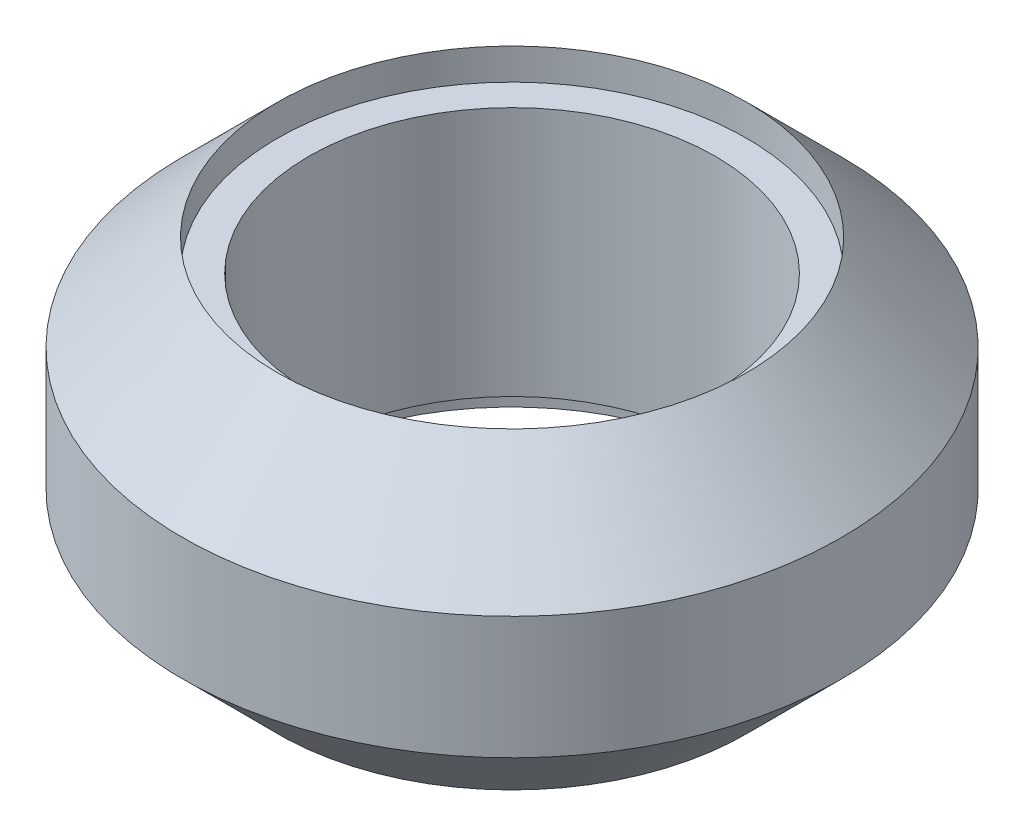
ISO-10303-21;
HEADER;
FILE_DESCRIPTION(('STEP AP214'),'2;1');
FILE_NAME('part.step','',(''),(''),'','','');
FILE_SCHEMA(('AUTOMOTIVE_DESIGN { 1 0 10303 214 1 1 1 1 }'));
ENDSEC;
DATA;
#1=APPLICATION_CONTEXT('core data for automotive mechanical design processes');
#2=APPLICATION_PROTOCOL_DEFINITION('international standard','automotive_design',2000,#1);
#3=PRODUCT_CONTEXT('',#1,'mechanical');
#4=PRODUCT('Part','Part','',(#3));
#5=PRODUCT_RELATED_PRODUCT_CATEGORY('part','',(#4));
#6=PRODUCT_DEFINITION_FORMATION('','',#4);
#7=PRODUCT_DEFINITION_CONTEXT('part definition',#1,'design');
#8=PRODUCT_DEFINITION('design','',#6,#7);
#9=PRODUCT_DEFINITION_SHAPE('','',#8);
#10=(LENGTH_UNIT() NAMED_UNIT(*) SI_UNIT(.MILLI.,.METRE.));
#11=(NAMED_UNIT(*) PLANE_ANGLE_UNIT() SI_UNIT($,.RADIAN.));
#12=(NAMED_UNIT(*) SI_UNIT($,.STERADIAN.) SOLID_ANGLE_UNIT());
#13=UNCERTAINTY_MEASURE_WITH_UNIT(LENGTH_MEASURE(1.E-05),#10,'distance_accuracy_value','');
#14=(GEOMETRIC_REPRESENTATION_CONTEXT(3) GLOBAL_UNCERTAINTY_ASSIGNED_CONTEXT((#13)) GLOBAL_UNIT_ASSIGNED_CONTEXT((#10,
#11,#12)) REPRESENTATION_CONTEXT('',''));
#15=CARTESIAN_POINT('',(0.,0.,0.));
#16=DIRECTION('',(0.,0.,1.));
#17=DIRECTION('',(1.,0.,0.));
#18=AXIS2_PLACEMENT_3D('',#15,#16,#17);
#19=CARTESIAN_POINT('',(0.,0.,0.));
#20=DIRECTION('',(0.,1.,0.));
#21=DIRECTION('',(0.,0.,1.));
#22=AXIS2_PLACEMENT_3D('',#19,#20,#21);
#23=CYLINDRICAL_SURFACE('',#22,6.5);
#24=CARTESIAN_POINT('',(0.,1.,0.));
#25=DIRECTION('',(0.,-1.,0.));
#26=DIRECTION('',(0.,0.,-1.));
#27=AXIS2_PLACEMENT_3D('',#24,#25,#26);
#28=CIRCLE('',#27,6.5);
#29=CARTESIAN_POINT('',(0.,1.,-6.5));
#30=VERTEX_POINT('',#29);
#31=EDGE_CURVE('E64',#30,#30,#28,.T.);
#32=ORIENTED_EDGE('',*,*,#31,.T.);
#33=EDGE_LOOP('',(#32));
#34=FACE_BOUND('',#33,.T.);
#35=CARTESIAN_POINT('',(0.,9.,0.));
#36=DIRECTION('',(0.,1.,0.));
#37=DIRECTION('',(0.,0.,1.));
#38=AXIS2_PLACEMENT_3D('',#35,#36,#37);
#39=CIRCLE('',#38,6.5);
#40=CARTESIAN_POINT('',(0.,9.,6.5));
#41=VERTEX_POINT('',#40);
#42=EDGE_CURVE('E74',#41,#41,#39,.T.);
#43=ORIENTED_EDGE('',*,*,#42,.T.);
#44=EDGE_LOOP('',(#43));
#45=FACE_BOUND('',#44,.T.);
#46=ADVANCED_FACE('F41',(#34,#45),#23,.F.);
#47=CARTESIAN_POINT('',(0.,6.95944084089784,0.));
#48=DIRECTION('',(0.,-1.,0.));
#49=DIRECTION('',(-1.,0.,0.));
#50=AXIS2_PLACEMENT_3D('',#47,#48,#49);
#51=CONICAL_SURFACE('',#50,10.5405591591022,0.78539816339745);
#52=CARTESIAN_POINT('',(0.,10.,0.));
#53=DIRECTION('',(0.,1.,0.));
#54=DIRECTION('',(0.,0.,1.));
#55=AXIS2_PLACEMENT_3D('',#52,#53,#54);
#56=CIRCLE('',#55,7.5);
#57=CARTESIAN_POINT('',(0.,10.,7.5));
#58=VERTEX_POINT('',#57);
#59=EDGE_CURVE('E70',#58,#58,#56,.T.);
#60=ORIENTED_EDGE('',*,*,#59,.F.);
#61=EDGE_LOOP('',(#60));
#62=FACE_BOUND('',#61,.T.);
#63=CARTESIAN_POINT('',(0.,6.95944084089784,0.));
#64=DIRECTION('',(0.,-1.,0.));
#65=DIRECTION('',(0.,0.,-1.));
#66=AXIS2_PLACEMENT_3D('',#63,#64,#65);
#67=CIRCLE('',#66,10.5405591591022);
#68=CARTESIAN_POINT('',(0.,6.95944084089784,-10.5405591591022));
#69=VERTEX_POINT('',#68);
#70=EDGE_CURVE('E49',#69,#69,#67,.T.);
#71=ORIENTED_EDGE('',*,*,#70,.F.);
#72=EDGE_LOOP('',(#71));
#73=FACE_BOUND('',#72,.T.);
#74=ADVANCED_FACE('F43',(#62,#73),#51,.T.);
#75=CARTESIAN_POINT('',(0.,-26.7726442764943,0.));
#76=DIRECTION('',(0.,1.,0.));
#77=DIRECTION('',(0.,0.,1.));
#78=AXIS2_PLACEMENT_3D('',#75,#76,#77);
#79=CYLINDRICAL_SURFACE('',#78,10.5405591591022);
#80=ORIENTED_EDGE('',*,*,#70,.T.);
#81=EDGE_LOOP('',(#80));
#82=FACE_BOUND('',#81,.T.);
#83=CARTESIAN_POINT('',(0.,3.04055915910215,0.));
#84=DIRECTION('',(0.,-1.,0.));
#85=DIRECTION('',(0.,0.,-1.));
#86=AXIS2_PLACEMENT_3D('',#83,#84,#85);
#87=CIRCLE('',#86,10.5405591591022);
#88=CARTESIAN_POINT('',(0.,3.04055915910215,-10.5405591591022));
#89=VERTEX_POINT('',#88);
#90=EDGE_CURVE('E10',#89,#89,#87,.T.);
#91=ORIENTED_EDGE('',*,*,#90,.F.);
#92=EDGE_LOOP('',(#91));
#93=FACE_BOUND('',#92,.T.);
#94=ADVANCED_FACE('F98',(#82,#93),#79,.T.);
#95=CARTESIAN_POINT('',(0.,3.04055915910215,0.));
#96=DIRECTION('',(0.,1.,0.));
#97=DIRECTION('',(0.,0.,-1.));
#98=AXIS2_PLACEMENT_3D('',#95,#96,#97);
#99=CONICAL_SURFACE('',#98,10.5405591591022,0.78539816339745);
#100=CARTESIAN_POINT('',(0.,0.,0.));
#101=DIRECTION('',(0.,-1.,0.));
#102=DIRECTION('',(0.,0.,-1.));
#103=AXIS2_PLACEMENT_3D('',#100,#101,#102);
#104=CIRCLE('',#103,7.5);
#105=CARTESIAN_POINT('',(0.,0.,-7.5));
#106=VERTEX_POINT('',#105);
#107=EDGE_CURVE('E59',#106,#106,#104,.T.);
#108=ORIENTED_EDGE('',*,*,#107,.F.);
#109=EDGE_LOOP('',(#108));
#110=FACE_BOUND('',#109,.T.);
#111=ORIENTED_EDGE('',*,*,#90,.T.);
#112=EDGE_LOOP('',(#111));
#113=FACE_BOUND('',#112,.T.);
#114=ADVANCED_FACE('F103',(#110,#113),#99,.T.);
#115=CARTESIAN_POINT('',(0.,1.,0.));
#116=DIRECTION('',(0.,-1.,0.));
#117=DIRECTION('',(0.,0.,-1.));
#118=AXIS2_PLACEMENT_3D('',#115,#116,#117);
#119=CYLINDRICAL_SURFACE('',#118,7.5);
#120=CARTESIAN_POINT('',(0.,1.,0.));
#121=DIRECTION('',(0.,-1.,0.));
#122=DIRECTION('',(0.,0.,-1.));
#123=AXIS2_PLACEMENT_3D('',#120,#121,#122);
#124=CIRCLE('',#123,7.5);
#125=CARTESIAN_POINT('',(0.,1.,-7.5));
#126=VERTEX_POINT('',#125);
#127=EDGE_CURVE('E54',#126,#126,#124,.T.);
#128=ORIENTED_EDGE('',*,*,#127,.F.);
#129=EDGE_LOOP('',(#128));
#130=FACE_BOUND('',#129,.T.);
#131=ORIENTED_EDGE('',*,*,#107,.T.);
#132=EDGE_LOOP('',(#131));
#133=FACE_BOUND('',#132,.T.);
#134=ADVANCED_FACE('F110',(#130,#133),#119,.F.);
#135=CARTESIAN_POINT('',(0.,1.,0.));
#136=DIRECTION('',(0.,-1.,0.));
#137=DIRECTION('',(0.,0.,-1.));
#138=AXIS2_PLACEMENT_3D('',#135,#136,#137);
#139=PLANE('',#138);
#140=ORIENTED_EDGE('',*,*,#31,.F.);
#141=EDGE_LOOP('',(#140));
#142=FACE_BOUND('',#141,.T.);
#143=ORIENTED_EDGE('',*,*,#127,.T.);
#144=EDGE_LOOP('',(#143));
#145=FACE_BOUND('',#144,.T.);
#146=ADVANCED_FACE('F92',(#142,#145),#139,.T.);
#147=CARTESIAN_POINT('',(0.,9.,0.));
#148=DIRECTION('',(0.,1.,0.));
#149=DIRECTION('',(0.,0.,1.));
#150=AXIS2_PLACEMENT_3D('',#147,#148,#149);
#151=CYLINDRICAL_SURFACE('',#150,7.5);
#152=CARTESIAN_POINT('',(0.,9.,0.));
#153=DIRECTION('',(0.,1.,0.));
#154=DIRECTION('',(0.,0.,1.));
#155=AXIS2_PLACEMENT_3D('',#152,#153,#154);
#156=CIRCLE('',#155,7.5);
#157=CARTESIAN_POINT('',(0.,9.,7.5));
#158=VERTEX_POINT('',#157);
#159=EDGE_CURVE('E69',#158,#158,#156,.T.);
#160=ORIENTED_EDGE('',*,*,#159,.F.);
#161=EDGE_LOOP('',(#160));
#162=FACE_BOUND('',#161,.T.);
#163=ORIENTED_EDGE('',*,*,#59,.T.);
#164=EDGE_LOOP('',(#163));
#165=FACE_BOUND('',#164,.T.);
#166=ADVANCED_FACE('F86',(#162,#165),#151,.F.);
#167=CARTESIAN_POINT('',(0.,9.,0.));
#168=DIRECTION('',(0.,1.,0.));
#169=DIRECTION('',(0.,0.,1.));
#170=AXIS2_PLACEMENT_3D('',#167,#168,#169);
#171=PLANE('',#170);
#172=ORIENTED_EDGE('',*,*,#42,.F.);
#173=EDGE_LOOP('',(#172));
#174=FACE_BOUND('',#173,.T.);
#175=ORIENTED_EDGE('',*,*,#159,.T.);
#176=EDGE_LOOP('',(#175));
#177=FACE_BOUND('',#176,.T.);
#178=ADVANCED_FACE('F83',(#174,#177),#171,.T.);
#179=CLOSED_SHELL('',(#46,#74,#94,#114,#134,#146,#166,#178));
#180=MANIFOLD_SOLID_BREP('B2',#179);
#181=ADVANCED_BREP_SHAPE_REPRESENTATION('',(#18,#180),#14);
#182=SHAPE_DEFINITION_REPRESENTATION(#9,#181);
ENDSEC;
END-ISO-10303-21;
